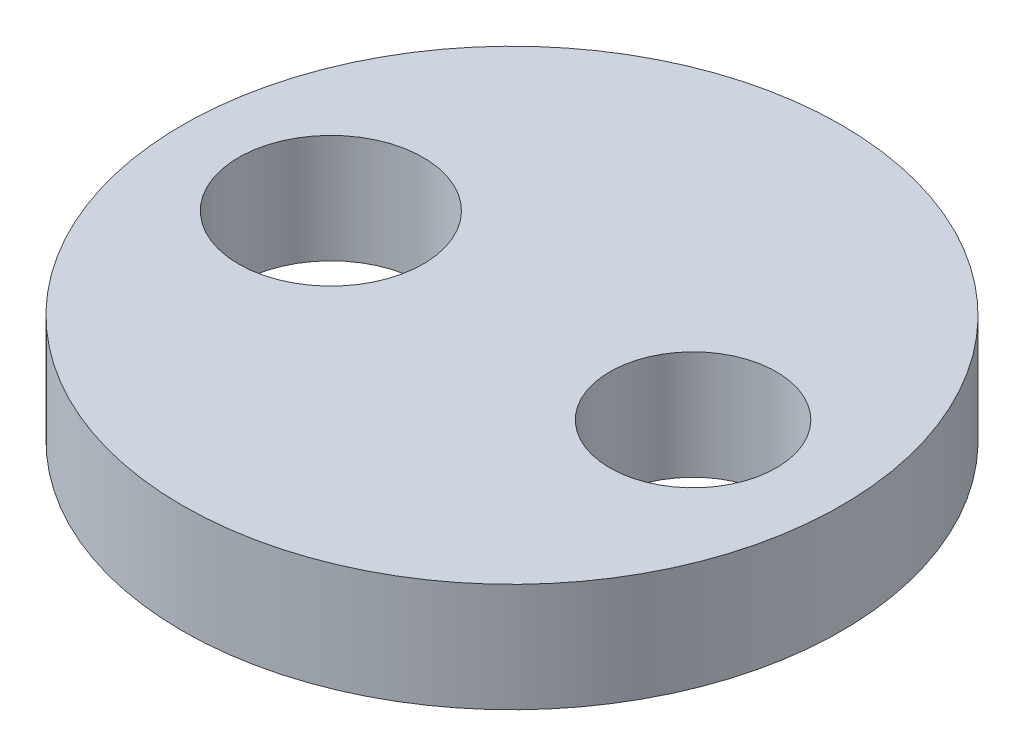
ISO-10303-21;
HEADER;
FILE_DESCRIPTION(('STEP AP214'),'2;1');
FILE_NAME('part.step','',(''),(''),'','','');
FILE_SCHEMA(('AUTOMOTIVE_DESIGN { 1 0 10303 214 1 1 1 1 }'));
ENDSEC;
DATA;
#1=APPLICATION_CONTEXT('core data for automotive mechanical design processes');
#2=APPLICATION_PROTOCOL_DEFINITION('international standard','automotive_design',2000,#1);
#3=PRODUCT_CONTEXT('',#1,'mechanical');
#4=PRODUCT('Part','Part','',(#3));
#5=PRODUCT_RELATED_PRODUCT_CATEGORY('part','',(#4));
#6=PRODUCT_DEFINITION_FORMATION('','',#4);
#7=PRODUCT_DEFINITION_CONTEXT('part definition',#1,'design');
#8=PRODUCT_DEFINITION('design','',#6,#7);
#9=PRODUCT_DEFINITION_SHAPE('','',#8);
#10=(LENGTH_UNIT() NAMED_UNIT(*) SI_UNIT(.MILLI.,.METRE.));
#11=(NAMED_UNIT(*) PLANE_ANGLE_UNIT() SI_UNIT($,.RADIAN.));
#12=(NAMED_UNIT(*) SI_UNIT($,.STERADIAN.) SOLID_ANGLE_UNIT());
#13=UNCERTAINTY_MEASURE_WITH_UNIT(LENGTH_MEASURE(1.E-05),#10,'distance_accuracy_value','');
#14=(GEOMETRIC_REPRESENTATION_CONTEXT(3) GLOBAL_UNCERTAINTY_ASSIGNED_CONTEXT((#13)) GLOBAL_UNIT_ASSIGNED_CONTEXT((#10,
#11,#12)) REPRESENTATION_CONTEXT('',''));
#15=CARTESIAN_POINT('',(0.,0.,0.));
#16=DIRECTION('',(0.,0.,1.));
#17=DIRECTION('',(1.,0.,0.));
#18=AXIS2_PLACEMENT_3D('',#15,#16,#17);
#19=CARTESIAN_POINT('',(0.,3.,0.));
#20=DIRECTION('',(0.,1.,0.));
#21=DIRECTION('',(0.,0.,1.));
#22=AXIS2_PLACEMENT_3D('',#19,#20,#21);
#23=PLANE('',#22);
#24=CARTESIAN_POINT('',(5.,3.,0.));
#25=DIRECTION('',(0.,1.,0.));
#26=DIRECTION('',(0.,0.,1.));
#27=AXIS2_PLACEMENT_3D('',#24,#25,#26);
#28=CIRCLE('',#27,2.3);
#29=CARTESIAN_POINT('',(5.,3.,2.3));
#30=VERTEX_POINT('',#29);
#31=EDGE_CURVE('E56',#30,#30,#28,.T.);
#32=ORIENTED_EDGE('',*,*,#31,.F.);
#33=EDGE_LOOP('',(#32));
#34=FACE_BOUND('',#33,.T.);
#35=CARTESIAN_POINT('',(0.,3.,0.));
#36=DIRECTION('',(0.,1.,0.));
#37=DIRECTION('',(0.,0.,1.));
#38=AXIS2_PLACEMENT_3D('',#35,#36,#37);
#39=CIRCLE('',#38,9.1);
#40=CARTESIAN_POINT('',(0.,3.,9.1));
#41=VERTEX_POINT('',#40);
#42=EDGE_CURVE('E10',#41,#41,#39,.T.);
#43=ORIENTED_EDGE('',*,*,#42,.T.);
#44=EDGE_LOOP('',(#43));
#45=FACE_BOUND('',#44,.T.);
#46=CARTESIAN_POINT('',(-5.,3.,0.000844512844806944));
#47=DIRECTION('',(0.,1.,0.));
#48=DIRECTION('',(0.,0.,1.));
#49=AXIS2_PLACEMENT_3D('',#46,#47,#48);
#50=CIRCLE('',#49,2.55);
#51=CARTESIAN_POINT('',(-5.,3.,2.55084451284481));
#52=VERTEX_POINT('',#51);
#53=EDGE_CURVE('E62',#52,#52,#50,.T.);
#54=ORIENTED_EDGE('',*,*,#53,.F.);
#55=EDGE_LOOP('',(#54));
#56=FACE_BOUND('',#55,.T.);
#57=ADVANCED_FACE('F43',(#34,#45,#56),#23,.T.);
#58=CARTESIAN_POINT('',(0.,0.,0.));
#59=DIRECTION('',(0.,1.,0.));
#60=DIRECTION('',(0.,0.,1.));
#61=AXIS2_PLACEMENT_3D('',#58,#59,#60);
#62=PLANE('',#61);
#63=CARTESIAN_POINT('',(0.,0.,0.));
#64=DIRECTION('',(0.,1.,0.));
#65=DIRECTION('',(0.,0.,1.));
#66=AXIS2_PLACEMENT_3D('',#63,#64,#65);
#67=CIRCLE('',#66,9.1);
#68=CARTESIAN_POINT('',(0.,0.,9.1));
#69=VERTEX_POINT('',#68);
#70=EDGE_CURVE('E47',#69,#69,#67,.T.);
#71=ORIENTED_EDGE('',*,*,#70,.F.);
#72=EDGE_LOOP('',(#71));
#73=FACE_BOUND('',#72,.T.);
#74=CARTESIAN_POINT('',(5.,0.,0.));
#75=DIRECTION('',(0.,1.,0.));
#76=DIRECTION('',(0.,0.,1.));
#77=AXIS2_PLACEMENT_3D('',#74,#75,#76);
#78=CIRCLE('',#77,2.3);
#79=CARTESIAN_POINT('',(5.,0.,2.3));
#80=VERTEX_POINT('',#79);
#81=EDGE_CURVE('E58',#80,#80,#78,.T.);
#82=ORIENTED_EDGE('',*,*,#81,.T.);
#83=EDGE_LOOP('',(#82));
#84=FACE_BOUND('',#83,.T.);
#85=CARTESIAN_POINT('',(-5.,0.,0.000844512844806944));
#86=DIRECTION('',(0.,1.,0.));
#87=DIRECTION('',(0.,0.,1.));
#88=AXIS2_PLACEMENT_3D('',#85,#86,#87);
#89=CIRCLE('',#88,2.55);
#90=CARTESIAN_POINT('',(-5.,0.,2.55084451284481));
#91=VERTEX_POINT('',#90);
#92=EDGE_CURVE('E66',#91,#91,#89,.T.);
#93=ORIENTED_EDGE('',*,*,#92,.T.);
#94=EDGE_LOOP('',(#93));
#95=FACE_BOUND('',#94,.T.);
#96=ADVANCED_FACE('F78',(#73,#84,#95),#62,.F.);
#97=CARTESIAN_POINT('',(0.,3.,0.));
#98=DIRECTION('',(0.,-1.,0.));
#99=DIRECTION('',(0.,0.,-1.));
#100=AXIS2_PLACEMENT_3D('',#97,#98,#99);
#101=CYLINDRICAL_SURFACE('',#100,9.1);
#102=ORIENTED_EDGE('',*,*,#42,.F.);
#103=EDGE_LOOP('',(#102));
#104=FACE_BOUND('',#103,.T.);
#105=ORIENTED_EDGE('',*,*,#70,.T.);
#106=EDGE_LOOP('',(#105));
#107=FACE_BOUND('',#106,.T.);
#108=ADVANCED_FACE('F45',(#104,#107),#101,.T.);
#109=CARTESIAN_POINT('',(5.,3.,0.));
#110=DIRECTION('',(0.,-1.,0.));
#111=DIRECTION('',(0.,0.,-1.));
#112=AXIS2_PLACEMENT_3D('',#109,#110,#111);
#113=CYLINDRICAL_SURFACE('',#112,2.3);
#114=ORIENTED_EDGE('',*,*,#31,.T.);
#115=EDGE_LOOP('',(#114));
#116=FACE_BOUND('',#115,.T.);
#117=ORIENTED_EDGE('',*,*,#81,.F.);
#118=EDGE_LOOP('',(#117));
#119=FACE_BOUND('',#118,.T.);
#120=ADVANCED_FACE('F87',(#116,#119),#113,.F.);
#121=CARTESIAN_POINT('',(-5.,3.,0.000844512844806944));
#122=DIRECTION('',(0.,-1.,0.));
#123=DIRECTION('',(0.,0.,-1.));
#124=AXIS2_PLACEMENT_3D('',#121,#122,#123);
#125=CYLINDRICAL_SURFACE('',#124,2.55);
#126=ORIENTED_EDGE('',*,*,#53,.T.);
#127=EDGE_LOOP('',(#126));
#128=FACE_BOUND('',#127,.T.);
#129=ORIENTED_EDGE('',*,*,#92,.F.);
#130=EDGE_LOOP('',(#129));
#131=FACE_BOUND('',#130,.T.);
#132=ADVANCED_FACE('F74',(#128,#131),#125,.F.);
#133=CLOSED_SHELL('',(#57,#96,#108,#120,#132));
#134=MANIFOLD_SOLID_BREP('B2',#133);
#135=ADVANCED_BREP_SHAPE_REPRESENTATION('',(#18,#134),#14);
#136=SHAPE_DEFINITION_REPRESENTATION(#9,#135);
ENDSEC;
END-ISO-10303-21;
